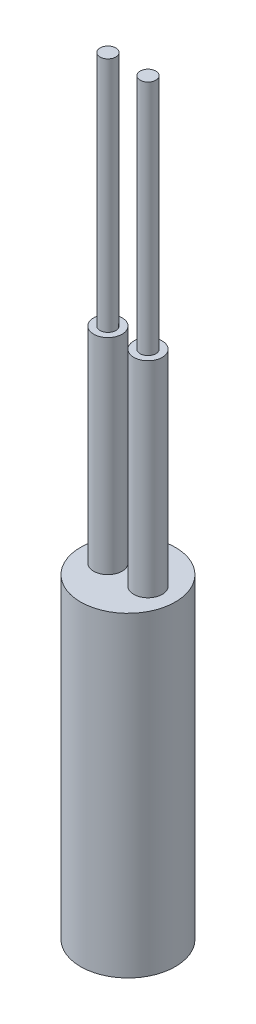
ISO-10303-21;
HEADER;
FILE_DESCRIPTION(('STEP AP214'),'2;1');
FILE_NAME('part.step','',(''),(''),'','','');
FILE_SCHEMA(('AUTOMOTIVE_DESIGN { 1 0 10303 214 1 1 1 1 }'));
ENDSEC;
DATA;
#1=APPLICATION_CONTEXT('core data for automotive mechanical design processes');
#2=APPLICATION_PROTOCOL_DEFINITION('international standard','automotive_design',2000,#1);
#3=PRODUCT_CONTEXT('',#1,'mechanical');
#4=PRODUCT('Part','Part','',(#3));
#5=PRODUCT_RELATED_PRODUCT_CATEGORY('part','',(#4));
#6=PRODUCT_DEFINITION_FORMATION('','',#4);
#7=PRODUCT_DEFINITION_CONTEXT('part definition',#1,'design');
#8=PRODUCT_DEFINITION('design','',#6,#7);
#9=PRODUCT_DEFINITION_SHAPE('','',#8);
#10=(LENGTH_UNIT() NAMED_UNIT(*) SI_UNIT(.MILLI.,.METRE.));
#11=(NAMED_UNIT(*) PLANE_ANGLE_UNIT() SI_UNIT($,.RADIAN.));
#12=(NAMED_UNIT(*) SI_UNIT($,.STERADIAN.) SOLID_ANGLE_UNIT());
#13=UNCERTAINTY_MEASURE_WITH_UNIT(LENGTH_MEASURE(1.E-05),#10,'distance_accuracy_value','');
#14=(GEOMETRIC_REPRESENTATION_CONTEXT(3) GLOBAL_UNCERTAINTY_ASSIGNED_CONTEXT((#13)) GLOBAL_UNIT_ASSIGNED_CONTEXT((#10,
#11,#12)) REPRESENTATION_CONTEXT('',''));
#15=CARTESIAN_POINT('',(0.,0.,0.));
#16=DIRECTION('',(0.,0.,1.));
#17=DIRECTION('',(1.,0.,0.));
#18=AXIS2_PLACEMENT_3D('',#15,#16,#17);
#19=CARTESIAN_POINT('',(0.,20.,0.));
#20=DIRECTION('',(0.,-1.,0.));
#21=DIRECTION('',(0.,0.,-1.));
#22=AXIS2_PLACEMENT_3D('',#19,#20,#21);
#23=CYLINDRICAL_SURFACE('',#22,3.);
#24=CARTESIAN_POINT('',(0.,20.,0.));
#25=DIRECTION('',(0.,1.,0.));
#26=DIRECTION('',(0.,0.,1.));
#27=AXIS2_PLACEMENT_3D('',#24,#25,#26);
#28=CIRCLE('',#27,3.);
#29=CARTESIAN_POINT('',(0.,20.,3.));
#30=VERTEX_POINT('',#29);
#31=EDGE_CURVE('E45',#30,#30,#28,.T.);
#32=ORIENTED_EDGE('',*,*,#31,.F.);
#33=EDGE_LOOP('',(#32));
#34=FACE_BOUND('',#33,.T.);
#35=CARTESIAN_POINT('',(0.,0.,0.));
#36=DIRECTION('',(0.,1.,0.));
#37=DIRECTION('',(0.,0.,1.));
#38=AXIS2_PLACEMENT_3D('',#35,#36,#37);
#39=CIRCLE('',#38,3.);
#40=CARTESIAN_POINT('',(0.,0.,3.));
#41=VERTEX_POINT('',#40);
#42=EDGE_CURVE('E36',#41,#41,#39,.T.);
#43=ORIENTED_EDGE('',*,*,#42,.T.);
#44=EDGE_LOOP('',(#43));
#45=FACE_BOUND('',#44,.T.);
#46=ADVANCED_FACE('F33',(#34,#45),#23,.T.);
#47=CARTESIAN_POINT('',(0.,20.,0.));
#48=DIRECTION('',(0.,1.,0.));
#49=DIRECTION('',(0.,0.,1.));
#50=AXIS2_PLACEMENT_3D('',#47,#48,#49);
#51=PLANE('',#50);
#52=CARTESIAN_POINT('',(-1.27,20.,0.));
#53=DIRECTION('',(0.,1.,0.));
#54=DIRECTION('',(0.,0.,-1.));
#55=AXIS2_PLACEMENT_3D('',#52,#53,#54);
#56=CIRCLE('',#55,0.9);
#57=CARTESIAN_POINT('',(-1.27,20.,-0.899999999999998));
#58=VERTEX_POINT('',#57);
#59=EDGE_CURVE('E52',#58,#58,#56,.T.);
#60=ORIENTED_EDGE('',*,*,#59,.F.);
#61=EDGE_LOOP('',(#60));
#62=FACE_BOUND('',#61,.T.);
#63=CARTESIAN_POINT('',(1.27,20.,0.));
#64=DIRECTION('',(0.,1.,0.));
#65=DIRECTION('',(0.,0.,1.));
#66=AXIS2_PLACEMENT_3D('',#63,#64,#65);
#67=CIRCLE('',#66,0.9);
#68=CARTESIAN_POINT('',(1.27,20.,0.900000000000002));
#69=VERTEX_POINT('',#68);
#70=EDGE_CURVE('E57',#69,#69,#67,.T.);
#71=ORIENTED_EDGE('',*,*,#70,.F.);
#72=EDGE_LOOP('',(#71));
#73=FACE_BOUND('',#72,.T.);
#74=ORIENTED_EDGE('',*,*,#31,.T.);
#75=EDGE_LOOP('',(#74));
#76=FACE_BOUND('',#75,.T.);
#77=ADVANCED_FACE('F74',(#62,#73,#76),#51,.T.);
#78=CARTESIAN_POINT('',(0.,0.,0.));
#79=DIRECTION('',(0.,1.,0.));
#80=DIRECTION('',(0.,0.,1.));
#81=AXIS2_PLACEMENT_3D('',#78,#79,#80);
#82=PLANE('',#81);
#83=ORIENTED_EDGE('',*,*,#42,.F.);
#84=EDGE_LOOP('',(#83));
#85=FACE_BOUND('',#84,.T.);
#86=ADVANCED_FACE('F71',(#85),#82,.F.);
#87=CARTESIAN_POINT('',(1.27,33.,0.));
#88=DIRECTION('',(0.,-1.,0.));
#89=DIRECTION('',(0.,0.,-1.));
#90=AXIS2_PLACEMENT_3D('',#87,#88,#89);
#91=CYLINDRICAL_SURFACE('',#90,0.9);
#92=CARTESIAN_POINT('',(1.27,33.,0.));
#93=DIRECTION('',(0.,1.,0.));
#94=DIRECTION('',(0.,0.,1.));
#95=AXIS2_PLACEMENT_3D('',#92,#93,#94);
#96=CIRCLE('',#95,0.9);
#97=CARTESIAN_POINT('',(1.27,33.,0.900000000000002));
#98=VERTEX_POINT('',#97);
#99=EDGE_CURVE('E60',#98,#98,#96,.T.);
#100=ORIENTED_EDGE('',*,*,#99,.F.);
#101=EDGE_LOOP('',(#100));
#102=FACE_BOUND('',#101,.T.);
#103=ORIENTED_EDGE('',*,*,#70,.T.);
#104=EDGE_LOOP('',(#103));
#105=FACE_BOUND('',#104,.T.);
#106=ADVANCED_FACE('F73',(#102,#105),#91,.T.);
#107=CARTESIAN_POINT('',(1.27,33.,0.));
#108=DIRECTION('',(0.,1.,0.));
#109=DIRECTION('',(0.,0.,1.));
#110=AXIS2_PLACEMENT_3D('',#107,#108,#109);
#111=PLANE('',#110);
#112=CARTESIAN_POINT('',(1.27,33.,0.));
#113=DIRECTION('',(0.,1.,0.));
#114=DIRECTION('',(0.,0.,1.));
#115=AXIS2_PLACEMENT_3D('',#112,#113,#114);
#116=CIRCLE('',#115,0.5);
#117=CARTESIAN_POINT('',(1.27,33.,0.500000000000002));
#118=VERTEX_POINT('',#117);
#119=EDGE_CURVE('E40',#118,#118,#116,.T.);
#120=ORIENTED_EDGE('',*,*,#119,.F.);
#121=EDGE_LOOP('',(#120));
#122=FACE_BOUND('',#121,.T.);
#123=ORIENTED_EDGE('',*,*,#99,.T.);
#124=EDGE_LOOP('',(#123));
#125=FACE_BOUND('',#124,.T.);
#126=ADVANCED_FACE('F79',(#122,#125),#111,.T.);
#127=CARTESIAN_POINT('',(-1.27,33.,0.));
#128=DIRECTION('',(0.,-1.,0.));
#129=DIRECTION('',(0.,0.,-1.));
#130=AXIS2_PLACEMENT_3D('',#127,#128,#129);
#131=CYLINDRICAL_SURFACE('',#130,0.9);
#132=CARTESIAN_POINT('',(-1.27,33.,0.));
#133=DIRECTION('',(0.,1.,0.));
#134=DIRECTION('',(0.,0.,-1.));
#135=AXIS2_PLACEMENT_3D('',#132,#133,#134);
#136=CIRCLE('',#135,0.9);
#137=CARTESIAN_POINT('',(-1.27,33.,-0.899999999999998));
#138=VERTEX_POINT('',#137);
#139=EDGE_CURVE('E54',#138,#138,#136,.T.);
#140=ORIENTED_EDGE('',*,*,#139,.F.);
#141=EDGE_LOOP('',(#140));
#142=FACE_BOUND('',#141,.T.);
#143=ORIENTED_EDGE('',*,*,#59,.T.);
#144=EDGE_LOOP('',(#143));
#145=FACE_BOUND('',#144,.T.);
#146=ADVANCED_FACE('F108',(#142,#145),#131,.T.);
#147=CARTESIAN_POINT('',(-1.27,33.,0.));
#148=DIRECTION('',(0.,-1.,0.));
#149=DIRECTION('',(0.,0.,-1.));
#150=AXIS2_PLACEMENT_3D('',#147,#148,#149);
#151=PLANE('',#150);
#152=CARTESIAN_POINT('',(-1.27,33.,0.));
#153=DIRECTION('',(0.,1.,0.));
#154=DIRECTION('',(0.,0.,1.));
#155=AXIS2_PLACEMENT_3D('',#152,#153,#154);
#156=CIRCLE('',#155,0.5);
#157=CARTESIAN_POINT('',(-1.27,33.,0.500000000000002));
#158=VERTEX_POINT('',#157);
#159=EDGE_CURVE('E10',#158,#158,#156,.T.);
#160=ORIENTED_EDGE('',*,*,#159,.F.);
#161=EDGE_LOOP('',(#160));
#162=FACE_BOUND('',#161,.T.);
#163=ORIENTED_EDGE('',*,*,#139,.T.);
#164=EDGE_LOOP('',(#163));
#165=FACE_BOUND('',#164,.T.);
#166=ADVANCED_FACE('F113',(#162,#165),#151,.F.);
#167=CARTESIAN_POINT('',(1.27,48.,0.));
#168=DIRECTION('',(0.,-1.,0.));
#169=DIRECTION('',(0.,0.,-1.));
#170=AXIS2_PLACEMENT_3D('',#167,#168,#169);
#171=CYLINDRICAL_SURFACE('',#170,0.5);
#172=CARTESIAN_POINT('',(1.27,48.,0.));
#173=DIRECTION('',(0.,1.,0.));
#174=DIRECTION('',(0.,0.,1.));
#175=AXIS2_PLACEMENT_3D('',#172,#173,#174);
#176=CIRCLE('',#175,0.5);
#177=CARTESIAN_POINT('',(1.27,48.,0.500000000000002));
#178=VERTEX_POINT('',#177);
#179=EDGE_CURVE('E50',#178,#178,#176,.T.);
#180=ORIENTED_EDGE('',*,*,#179,.F.);
#181=EDGE_LOOP('',(#180));
#182=FACE_BOUND('',#181,.T.);
#183=ORIENTED_EDGE('',*,*,#119,.T.);
#184=EDGE_LOOP('',(#183));
#185=FACE_BOUND('',#184,.T.);
#186=ADVANCED_FACE('F133',(#182,#185),#171,.T.);
#187=CARTESIAN_POINT('',(1.27,48.,0.));
#188=DIRECTION('',(0.,1.,0.));
#189=DIRECTION('',(0.,0.,1.));
#190=AXIS2_PLACEMENT_3D('',#187,#188,#189);
#191=PLANE('',#190);
#192=ORIENTED_EDGE('',*,*,#179,.T.);
#193=EDGE_LOOP('',(#192));
#194=FACE_BOUND('',#193,.T.);
#195=ADVANCED_FACE('F143',(#194),#191,.T.);
#196=CARTESIAN_POINT('',(-1.27,48.,0.));
#197=DIRECTION('',(0.,-1.,0.));
#198=DIRECTION('',(0.,0.,-1.));
#199=AXIS2_PLACEMENT_3D('',#196,#197,#198);
#200=CYLINDRICAL_SURFACE('',#199,0.5);
#201=CARTESIAN_POINT('',(-1.27,48.,0.));
#202=DIRECTION('',(0.,1.,0.));
#203=DIRECTION('',(0.,0.,1.));
#204=AXIS2_PLACEMENT_3D('',#201,#202,#203);
#205=CIRCLE('',#204,0.5);
#206=CARTESIAN_POINT('',(-1.27,48.,0.500000000000002));
#207=VERTEX_POINT('',#206);
#208=EDGE_CURVE('E49',#207,#207,#205,.T.);
#209=ORIENTED_EDGE('',*,*,#208,.F.);
#210=EDGE_LOOP('',(#209));
#211=FACE_BOUND('',#210,.T.);
#212=ORIENTED_EDGE('',*,*,#159,.T.);
#213=EDGE_LOOP('',(#212));
#214=FACE_BOUND('',#213,.T.);
#215=ADVANCED_FACE('F153',(#211,#214),#200,.T.);
#216=CARTESIAN_POINT('',(-1.27,48.,0.));
#217=DIRECTION('',(0.,1.,0.));
#218=DIRECTION('',(0.,0.,1.));
#219=AXIS2_PLACEMENT_3D('',#216,#217,#218);
#220=PLANE('',#219);
#221=ORIENTED_EDGE('',*,*,#208,.T.);
#222=EDGE_LOOP('',(#221));
#223=FACE_BOUND('',#222,.T.);
#224=ADVANCED_FACE('F163',(#223),#220,.T.);
#225=CLOSED_SHELL('',(#46,#77,#86,#106,#126,#146,#166,#186,#195,#215,#224));
#226=MANIFOLD_SOLID_BREP('B2',#225);
#227=ADVANCED_BREP_SHAPE_REPRESENTATION('',(#18,#226),#14);
#228=SHAPE_DEFINITION_REPRESENTATION(#9,#227);
ENDSEC;
END-ISO-10303-21;
